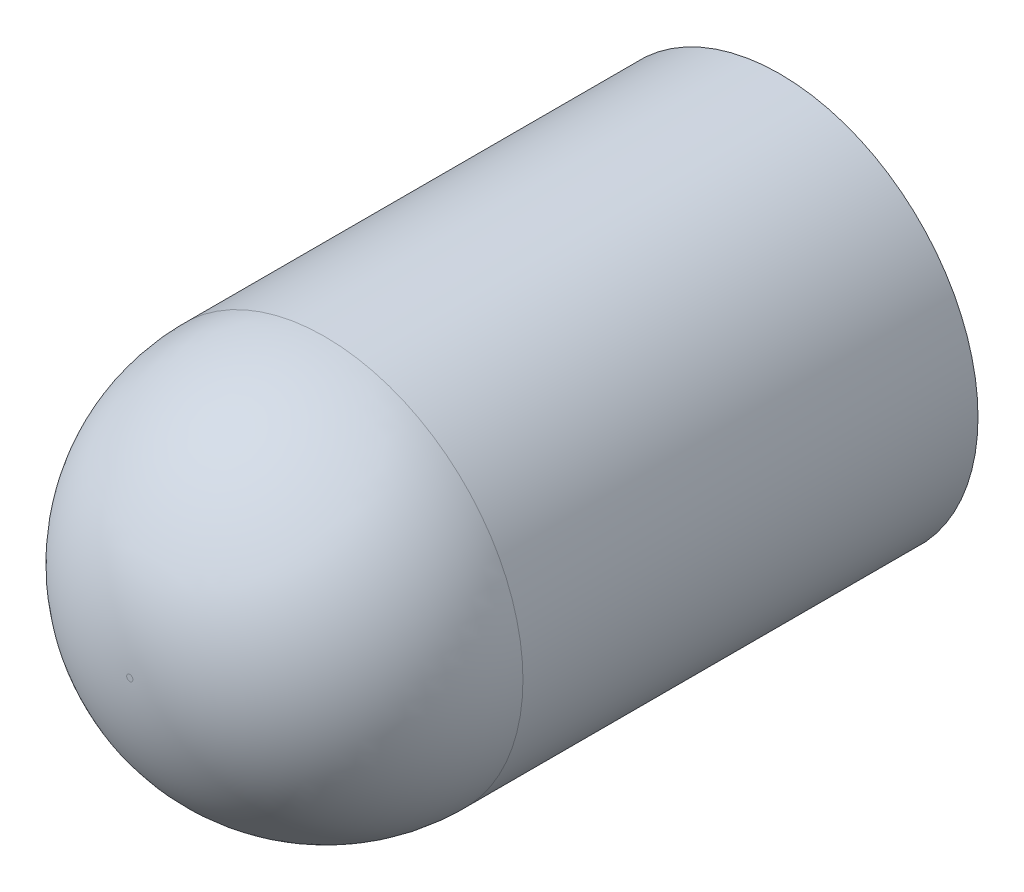
ISO-10303-21;
HEADER;
FILE_DESCRIPTION(('STEP AP214'),'2;1');
FILE_NAME('part.step','',(''),(''),'','','');
FILE_SCHEMA(('AUTOMOTIVE_DESIGN { 1 0 10303 214 1 1 1 1 }'));
ENDSEC;
DATA;
#1=APPLICATION_CONTEXT('core data for automotive mechanical design processes');
#2=APPLICATION_PROTOCOL_DEFINITION('international standard','automotive_design',2000,#1);
#3=PRODUCT_CONTEXT('',#1,'mechanical');
#4=PRODUCT('Part','Part','',(#3));
#5=PRODUCT_RELATED_PRODUCT_CATEGORY('part','',(#4));
#6=PRODUCT_DEFINITION_FORMATION('','',#4);
#7=PRODUCT_DEFINITION_CONTEXT('part definition',#1,'design');
#8=PRODUCT_DEFINITION('design','',#6,#7);
#9=PRODUCT_DEFINITION_SHAPE('','',#8);
#10=(LENGTH_UNIT() NAMED_UNIT(*) SI_UNIT(.MILLI.,.METRE.));
#11=(NAMED_UNIT(*) PLANE_ANGLE_UNIT() SI_UNIT($,.RADIAN.));
#12=(NAMED_UNIT(*) SI_UNIT($,.STERADIAN.) SOLID_ANGLE_UNIT());
#13=UNCERTAINTY_MEASURE_WITH_UNIT(LENGTH_MEASURE(1.E-05),#10,'distance_accuracy_value','');
#14=(GEOMETRIC_REPRESENTATION_CONTEXT(3) GLOBAL_UNCERTAINTY_ASSIGNED_CONTEXT((#13)) GLOBAL_UNIT_ASSIGNED_CONTEXT((#10,
#11,#12)) REPRESENTATION_CONTEXT('',''));
#15=CARTESIAN_POINT('',(0.,0.,0.));
#16=DIRECTION('',(0.,0.,1.));
#17=DIRECTION('',(1.,0.,0.));
#18=AXIS2_PLACEMENT_3D('',#15,#16,#17);
#19=CARTESIAN_POINT('',(0.,0.,10.));
#20=DIRECTION('',(0.,0.,-1.));
#21=DIRECTION('',(-1.,0.,0.));
#22=AXIS2_PLACEMENT_3D('',#19,#20,#21);
#23=CYLINDRICAL_SURFACE('',#22,3.048);
#24=CARTESIAN_POINT('',(0.,0.,7.));
#25=DIRECTION('',(0.,0.,1.));
#26=DIRECTION('',(1.,0.,0.));
#27=AXIS2_PLACEMENT_3D('',#24,#25,#26);
#28=CIRCLE('',#27,3.048);
#29=CARTESIAN_POINT('',(3.048,0.,7.));
#30=VERTEX_POINT('',#29);
#31=EDGE_CURVE('E10',#30,#30,#28,.F.);
#32=ORIENTED_EDGE('',*,*,#31,.T.);
#33=EDGE_LOOP('',(#32));
#34=FACE_BOUND('',#33,.T.);
#35=CARTESIAN_POINT('',(0.,0.,0.));
#36=DIRECTION('',(0.,0.,1.));
#37=DIRECTION('',(1.,0.,0.));
#38=AXIS2_PLACEMENT_3D('',#35,#36,#37);
#39=CIRCLE('',#38,3.048);
#40=CARTESIAN_POINT('',(3.048,0.,0.));
#41=VERTEX_POINT('',#40);
#42=EDGE_CURVE('E42',#41,#41,#39,.T.);
#43=ORIENTED_EDGE('',*,*,#42,.T.);
#44=EDGE_LOOP('',(#43));
#45=FACE_BOUND('',#44,.T.);
#46=ADVANCED_FACE('F31',(#34,#45),#23,.T.);
#47=CARTESIAN_POINT('',(0.,0.,10.));
#48=DIRECTION('',(0.,0.,1.));
#49=DIRECTION('',(1.,0.,0.));
#50=AXIS2_PLACEMENT_3D('',#47,#48,#49);
#51=PLANE('',#50);
#52=CARTESIAN_POINT('',(0.,0.,10.));
#53=DIRECTION('',(0.,0.,1.));
#54=DIRECTION('',(1.,0.,0.));
#55=AXIS2_PLACEMENT_3D('',#52,#53,#54);
#56=CIRCLE('',#55,0.0479999999999994);
#57=CARTESIAN_POINT('',(0.0479999999999994,0.,10.));
#58=VERTEX_POINT('',#57);
#59=EDGE_CURVE('E38',#58,#58,#56,.T.);
#60=ORIENTED_EDGE('',*,*,#59,.T.);
#61=EDGE_LOOP('',(#60));
#62=FACE_BOUND('',#61,.T.);
#63=ADVANCED_FACE('F52',(#62),#51,.T.);
#64=CARTESIAN_POINT('',(0.,0.,0.));
#65=DIRECTION('',(0.,0.,1.));
#66=DIRECTION('',(1.,0.,0.));
#67=AXIS2_PLACEMENT_3D('',#64,#65,#66);
#68=PLANE('',#67);
#69=ORIENTED_EDGE('',*,*,#42,.F.);
#70=EDGE_LOOP('',(#69));
#71=FACE_BOUND('',#70,.T.);
#72=ADVANCED_FACE('F50',(#71),#68,.F.);
#73=CARTESIAN_POINT('',(0.,0.,7.));
#74=DIRECTION('',(0.,0.,1.));
#75=DIRECTION('',(1.,0.,0.));
#76=AXIS2_PLACEMENT_3D('',#73,#74,#75);
#77=DEGENERATE_TOROIDAL_SURFACE('',#76,0.0479999999999994,3.,.T.);
#78=ORIENTED_EDGE('',*,*,#31,.F.);
#79=EDGE_LOOP('',(#78));
#80=FACE_BOUND('',#79,.T.);
#81=ORIENTED_EDGE('',*,*,#59,.F.);
#82=EDGE_LOOP('',(#81));
#83=FACE_BOUND('',#82,.T.);
#84=ADVANCED_FACE('F33',(#80,#83),#77,.T.);
#85=CLOSED_SHELL('',(#46,#63,#72,#84));
#86=MANIFOLD_SOLID_BREP('B2',#85);
#87=ADVANCED_BREP_SHAPE_REPRESENTATION('',(#18,#86),#14);
#88=SHAPE_DEFINITION_REPRESENTATION(#9,#87);
ENDSEC;
END-ISO-10303-21;
